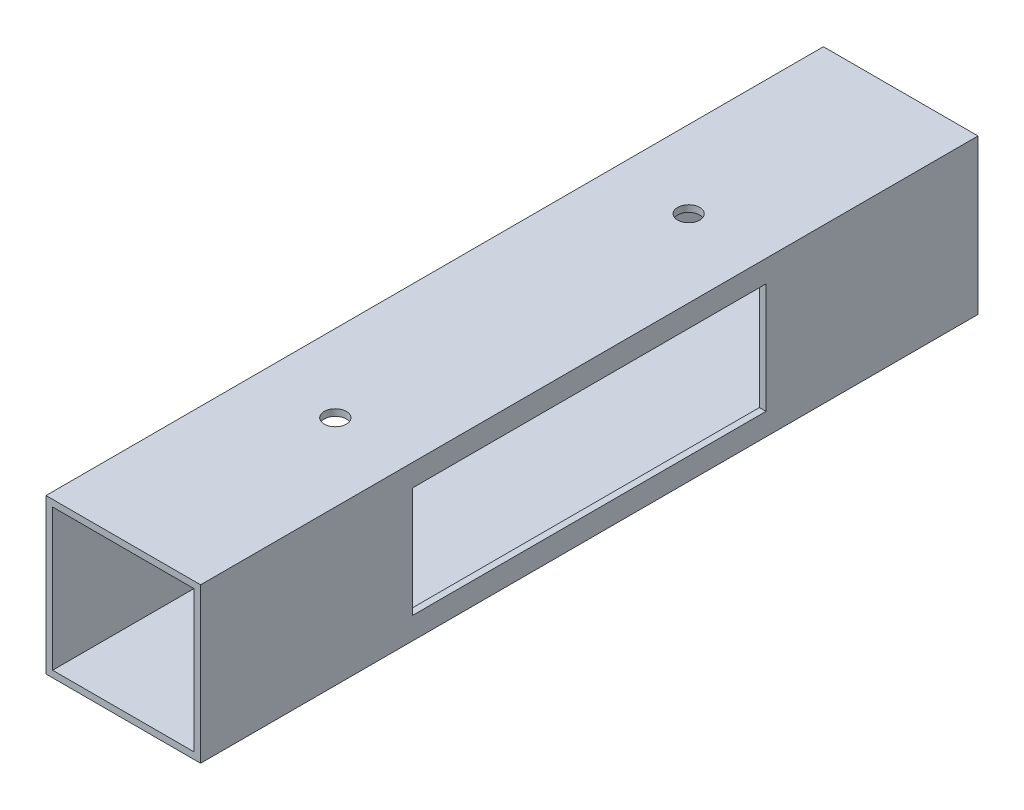
ISO-10303-21;
HEADER;
FILE_DESCRIPTION(('STEP AP214'),'2;1');
FILE_NAME('part.step','',(''),(''),'','','');
FILE_SCHEMA(('AUTOMOTIVE_DESIGN { 1 0 10303 214 1 1 1 1 }'));
ENDSEC;
DATA;
#1=APPLICATION_CONTEXT('core data for automotive mechanical design processes');
#2=APPLICATION_PROTOCOL_DEFINITION('international standard','automotive_design',2000,#1);
#3=PRODUCT_CONTEXT('',#1,'mechanical');
#4=PRODUCT('Part','Part','',(#3));
#5=PRODUCT_RELATED_PRODUCT_CATEGORY('part','',(#4));
#6=PRODUCT_DEFINITION_FORMATION('','',#4);
#7=PRODUCT_DEFINITION_CONTEXT('part definition',#1,'design');
#8=PRODUCT_DEFINITION('design','',#6,#7);
#9=PRODUCT_DEFINITION_SHAPE('','',#8);
#10=(LENGTH_UNIT() NAMED_UNIT(*) SI_UNIT(.MILLI.,.METRE.));
#11=(NAMED_UNIT(*) PLANE_ANGLE_UNIT() SI_UNIT($,.RADIAN.));
#12=(NAMED_UNIT(*) SI_UNIT($,.STERADIAN.) SOLID_ANGLE_UNIT());
#13=UNCERTAINTY_MEASURE_WITH_UNIT(LENGTH_MEASURE(1.E-05),#10,'distance_accuracy_value','');
#14=(GEOMETRIC_REPRESENTATION_CONTEXT(3) GLOBAL_UNCERTAINTY_ASSIGNED_CONTEXT((#13)) GLOBAL_UNIT_ASSIGNED_CONTEXT((#10,
#11,#12)) REPRESENTATION_CONTEXT('',''));
#15=CARTESIAN_POINT('',(0.,0.,0.));
#16=DIRECTION('',(0.,0.,1.));
#17=DIRECTION('',(1.,0.,0.));
#18=AXIS2_PLACEMENT_3D('',#15,#16,#17);
#19=CARTESIAN_POINT('',(0.,0.,88.));
#20=DIRECTION('',(0.,0.,-1.));
#21=DIRECTION('',(-1.,0.,0.));
#22=AXIS2_PLACEMENT_3D('',#19,#20,#21);
#23=PLANE('',#22);
#24=DIRECTION('',(0.,-1.,0.));
#25=VECTOR('',#24,1.);
#26=CARTESIAN_POINT('',(-17.5,-17.5,88.));
#27=LINE('',#26,#25);
#28=CARTESIAN_POINT('',(-17.5,17.5,88.));
#29=VERTEX_POINT('',#28);
#30=CARTESIAN_POINT('',(-17.5,-17.5,88.));
#31=VERTEX_POINT('',#30);
#32=EDGE_CURVE('E236',#29,#31,#27,.T.);
#33=ORIENTED_EDGE('',*,*,#32,.T.);
#34=DIRECTION('',(1.,0.,0.));
#35=VECTOR('',#34,1.);
#36=CARTESIAN_POINT('',(-17.5,-17.5,88.));
#37=LINE('',#36,#35);
#38=CARTESIAN_POINT('',(17.5,-17.5,88.));
#39=VERTEX_POINT('',#38);
#40=EDGE_CURVE('E239',#31,#39,#37,.T.);
#41=ORIENTED_EDGE('',*,*,#40,.T.);
#42=DIRECTION('',(0.,1.,0.));
#43=VECTOR('',#42,1.);
#44=CARTESIAN_POINT('',(17.5,-17.5,88.));
#45=LINE('',#44,#43);
#46=CARTESIAN_POINT('',(17.5,17.5,88.));
#47=VERTEX_POINT('',#46);
#48=EDGE_CURVE('E242',#39,#47,#45,.T.);
#49=ORIENTED_EDGE('',*,*,#48,.T.);
#50=DIRECTION('',(-1.,0.,0.));
#51=VECTOR('',#50,1.);
#52=CARTESIAN_POINT('',(-17.5,17.5,88.));
#53=LINE('',#52,#51);
#54=EDGE_CURVE('E244',#47,#29,#53,.T.);
#55=ORIENTED_EDGE('',*,*,#54,.T.);
#56=EDGE_LOOP('',(#33,#41,#49,#55));
#57=FACE_BOUND('',#56,.T.);
#58=DIRECTION('',(0.,-1.,0.));
#59=VECTOR('',#58,1.);
#60=CARTESIAN_POINT('',(-16.,-16.,88.));
#61=LINE('',#60,#59);
#62=CARTESIAN_POINT('',(-16.,16.,88.));
#63=VERTEX_POINT('',#62);
#64=CARTESIAN_POINT('',(-16.,-16.,88.));
#65=VERTEX_POINT('',#64);
#66=EDGE_CURVE('E205',#63,#65,#61,.T.);
#67=ORIENTED_EDGE('',*,*,#66,.F.);
#68=DIRECTION('',(-1.,0.,0.));
#69=VECTOR('',#68,1.);
#70=CARTESIAN_POINT('',(-16.,16.,88.));
#71=LINE('',#70,#69);
#72=CARTESIAN_POINT('',(16.,16.,88.));
#73=VERTEX_POINT('',#72);
#74=EDGE_CURVE('E213',#73,#63,#71,.T.);
#75=ORIENTED_EDGE('',*,*,#74,.F.);
#76=DIRECTION('',(0.,1.,0.));
#77=VECTOR('',#76,1.);
#78=CARTESIAN_POINT('',(16.,-16.,88.));
#79=LINE('',#78,#77);
#80=CARTESIAN_POINT('',(16.,-16.,88.));
#81=VERTEX_POINT('',#80);
#82=EDGE_CURVE('E210',#81,#73,#79,.T.);
#83=ORIENTED_EDGE('',*,*,#82,.F.);
#84=DIRECTION('',(1.,0.,0.));
#85=VECTOR('',#84,1.);
#86=CARTESIAN_POINT('',(-16.,-16.,88.));
#87=LINE('',#86,#85);
#88=EDGE_CURVE('E207',#65,#81,#87,.T.);
#89=ORIENTED_EDGE('',*,*,#88,.F.);
#90=EDGE_LOOP('',(#67,#75,#83,#89));
#91=FACE_BOUND('',#90,.T.);
#92=ADVANCED_FACE('F32',(#57,#91),#23,.F.);
#93=CARTESIAN_POINT('',(0.,0.,-88.));
#94=DIRECTION('',(0.,0.,-1.));
#95=DIRECTION('',(-1.,0.,0.));
#96=AXIS2_PLACEMENT_3D('',#93,#94,#95);
#97=PLANE('',#96);
#98=DIRECTION('',(0.,-1.,0.));
#99=VECTOR('',#98,1.);
#100=CARTESIAN_POINT('',(-17.5,-17.5,-88.));
#101=LINE('',#100,#99);
#102=CARTESIAN_POINT('',(-17.5,17.5,-88.));
#103=VERTEX_POINT('',#102);
#104=CARTESIAN_POINT('',(-17.5,-17.5,-88.));
#105=VERTEX_POINT('',#104);
#106=EDGE_CURVE('E235',#103,#105,#101,.T.);
#107=ORIENTED_EDGE('',*,*,#106,.F.);
#108=DIRECTION('',(-1.,0.,0.));
#109=VECTOR('',#108,1.);
#110=CARTESIAN_POINT('',(-17.5,17.5,-88.));
#111=LINE('',#110,#109);
#112=CARTESIAN_POINT('',(17.5,17.5,-88.));
#113=VERTEX_POINT('',#112);
#114=EDGE_CURVE('E240',#113,#103,#111,.T.);
#115=ORIENTED_EDGE('',*,*,#114,.F.);
#116=DIRECTION('',(0.,1.,0.));
#117=VECTOR('',#116,1.);
#118=CARTESIAN_POINT('',(17.5,-17.5,-88.));
#119=LINE('',#118,#117);
#120=CARTESIAN_POINT('',(17.5,-17.5,-88.));
#121=VERTEX_POINT('',#120);
#122=EDGE_CURVE('E251',#121,#113,#119,.T.);
#123=ORIENTED_EDGE('',*,*,#122,.F.);
#124=DIRECTION('',(1.,0.,0.));
#125=VECTOR('',#124,1.);
#126=CARTESIAN_POINT('',(-17.5,-17.5,-88.));
#127=LINE('',#126,#125);
#128=EDGE_CURVE('E249',#105,#121,#127,.T.);
#129=ORIENTED_EDGE('',*,*,#128,.F.);
#130=EDGE_LOOP('',(#107,#115,#123,#129));
#131=FACE_BOUND('',#130,.T.);
#132=DIRECTION('',(-1.,0.,0.));
#133=VECTOR('',#132,1.);
#134=CARTESIAN_POINT('',(-16.,16.,-88.));
#135=LINE('',#134,#133);
#136=CARTESIAN_POINT('',(16.,16.,-88.));
#137=VERTEX_POINT('',#136);
#138=CARTESIAN_POINT('',(-16.,16.,-88.));
#139=VERTEX_POINT('',#138);
#140=EDGE_CURVE('E208',#137,#139,#135,.T.);
#141=ORIENTED_EDGE('',*,*,#140,.T.);
#142=DIRECTION('',(0.,-1.,0.));
#143=VECTOR('',#142,1.);
#144=CARTESIAN_POINT('',(-16.,-16.,-88.));
#145=LINE('',#144,#143);
#146=CARTESIAN_POINT('',(-16.,-16.,-88.));
#147=VERTEX_POINT('',#146);
#148=EDGE_CURVE('E204',#139,#147,#145,.T.);
#149=ORIENTED_EDGE('',*,*,#148,.T.);
#150=DIRECTION('',(1.,0.,0.));
#151=VECTOR('',#150,1.);
#152=CARTESIAN_POINT('',(-16.,-16.,-88.));
#153=LINE('',#152,#151);
#154=CARTESIAN_POINT('',(16.,-16.,-88.));
#155=VERTEX_POINT('',#154);
#156=EDGE_CURVE('E218',#147,#155,#153,.T.);
#157=ORIENTED_EDGE('',*,*,#156,.T.);
#158=DIRECTION('',(0.,1.,0.));
#159=VECTOR('',#158,1.);
#160=CARTESIAN_POINT('',(16.,-16.,-88.));
#161=LINE('',#160,#159);
#162=EDGE_CURVE('E221',#155,#137,#161,.T.);
#163=ORIENTED_EDGE('',*,*,#162,.T.);
#164=EDGE_LOOP('',(#141,#149,#157,#163));
#165=FACE_BOUND('',#164,.T.);
#166=ADVANCED_FACE('F301',(#131,#165),#97,.T.);
#167=CARTESIAN_POINT('',(-17.5,-17.5,88.));
#168=DIRECTION('',(1.,0.,0.));
#169=DIRECTION('',(0.,0.,-1.));
#170=AXIS2_PLACEMENT_3D('',#167,#168,#169);
#171=PLANE('',#170);
#172=DIRECTION('',(0.,0.,1.));
#173=VECTOR('',#172,1.);
#174=CARTESIAN_POINT('',(-17.5,12.5,40.));
#175=LINE('',#174,#173);
#176=CARTESIAN_POINT('',(-17.5,12.5,-40.));
#177=VERTEX_POINT('',#176);
#178=CARTESIAN_POINT('',(-17.5,12.5,40.));
#179=VERTEX_POINT('',#178);
#180=EDGE_CURVE('E170',#177,#179,#175,.T.);
#181=ORIENTED_EDGE('',*,*,#180,.T.);
#182=DIRECTION('',(0.,-1.,0.));
#183=VECTOR('',#182,1.);
#184=CARTESIAN_POINT('',(-17.5,12.5,40.));
#185=LINE('',#184,#183);
#186=CARTESIAN_POINT('',(-17.5,-12.5,40.));
#187=VERTEX_POINT('',#186);
#188=EDGE_CURVE('E153',#179,#187,#185,.T.);
#189=ORIENTED_EDGE('',*,*,#188,.T.);
#190=DIRECTION('',(0.,0.,-1.));
#191=VECTOR('',#190,1.);
#192=CARTESIAN_POINT('',(-17.5,-12.5,40.));
#193=LINE('',#192,#191);
#194=CARTESIAN_POINT('',(-17.5,-12.5,-40.));
#195=VERTEX_POINT('',#194);
#196=EDGE_CURVE('E163',#187,#195,#193,.T.);
#197=ORIENTED_EDGE('',*,*,#196,.T.);
#198=DIRECTION('',(0.,1.,0.));
#199=VECTOR('',#198,1.);
#200=CARTESIAN_POINT('',(-17.5,12.5,-40.));
#201=LINE('',#200,#199);
#202=EDGE_CURVE('E49',#195,#177,#201,.T.);
#203=ORIENTED_EDGE('',*,*,#202,.T.);
#204=EDGE_LOOP('',(#181,#189,#197,#203));
#205=FACE_BOUND('',#204,.T.);
#206=ORIENTED_EDGE('',*,*,#106,.T.);
#207=DIRECTION('',(0.,0.,-1.));
#208=VECTOR('',#207,1.);
#209=CARTESIAN_POINT('',(-17.5,-17.5,88.));
#210=LINE('',#209,#208);
#211=EDGE_CURVE('E262',#31,#105,#210,.T.);
#212=ORIENTED_EDGE('',*,*,#211,.F.);
#213=ORIENTED_EDGE('',*,*,#32,.F.);
#214=DIRECTION('',(0.,0.,-1.));
#215=VECTOR('',#214,1.);
#216=CARTESIAN_POINT('',(-17.5,17.5,88.));
#217=LINE('',#216,#215);
#218=EDGE_CURVE('E246',#29,#103,#217,.T.);
#219=ORIENTED_EDGE('',*,*,#218,.T.);
#220=EDGE_LOOP('',(#206,#212,#213,#219));
#221=FACE_BOUND('',#220,.T.);
#222=ADVANCED_FACE('F34',(#205,#221),#171,.F.);
#223=CARTESIAN_POINT('',(-17.5,-17.5,88.));
#224=DIRECTION('',(0.,1.,0.));
#225=DIRECTION('',(0.,0.,1.));
#226=AXIS2_PLACEMENT_3D('',#223,#224,#225);
#227=PLANE('',#226);
#228=ORIENTED_EDGE('',*,*,#128,.T.);
#229=DIRECTION('',(0.,0.,-1.));
#230=VECTOR('',#229,1.);
#231=CARTESIAN_POINT('',(17.5,-17.5,88.));
#232=LINE('',#231,#230);
#233=EDGE_CURVE('E259',#39,#121,#232,.T.);
#234=ORIENTED_EDGE('',*,*,#233,.F.);
#235=ORIENTED_EDGE('',*,*,#40,.F.);
#236=ORIENTED_EDGE('',*,*,#211,.T.);
#237=EDGE_LOOP('',(#228,#234,#235,#236));
#238=FACE_BOUND('',#237,.T.);
#239=ADVANCED_FACE('F305',(#238),#227,.F.);
#240=CARTESIAN_POINT('',(17.5,-17.5,88.));
#241=DIRECTION('',(-1.,0.,0.));
#242=DIRECTION('',(0.,-1.,0.));
#243=AXIS2_PLACEMENT_3D('',#240,#241,#242);
#244=PLANE('',#243);
#245=DIRECTION('',(0.,0.,-1.));
#246=VECTOR('',#245,1.);
#247=CARTESIAN_POINT('',(17.5,-12.5,40.));
#248=LINE('',#247,#246);
#249=CARTESIAN_POINT('',(17.5,-12.5,40.));
#250=VERTEX_POINT('',#249);
#251=CARTESIAN_POINT('',(17.5,-12.5,-40.));
#252=VERTEX_POINT('',#251);
#253=EDGE_CURVE('E183',#250,#252,#248,.T.);
#254=ORIENTED_EDGE('',*,*,#253,.F.);
#255=DIRECTION('',(0.,-1.,0.));
#256=VECTOR('',#255,1.);
#257=CARTESIAN_POINT('',(17.5,12.5,40.));
#258=LINE('',#257,#256);
#259=CARTESIAN_POINT('',(17.5,12.5,40.));
#260=VERTEX_POINT('',#259);
#261=EDGE_CURVE('E57',#260,#250,#258,.T.);
#262=ORIENTED_EDGE('',*,*,#261,.F.);
#263=DIRECTION('',(0.,0.,1.));
#264=VECTOR('',#263,1.);
#265=CARTESIAN_POINT('',(17.5,12.5,40.));
#266=LINE('',#265,#264);
#267=CARTESIAN_POINT('',(17.5,12.5,-40.));
#268=VERTEX_POINT('',#267);
#269=EDGE_CURVE('E171',#268,#260,#266,.T.);
#270=ORIENTED_EDGE('',*,*,#269,.F.);
#271=DIRECTION('',(0.,1.,0.));
#272=VECTOR('',#271,1.);
#273=CARTESIAN_POINT('',(17.5,12.5,-40.));
#274=LINE('',#273,#272);
#275=EDGE_CURVE('E174',#252,#268,#274,.T.);
#276=ORIENTED_EDGE('',*,*,#275,.F.);
#277=EDGE_LOOP('',(#254,#262,#270,#276));
#278=FACE_BOUND('',#277,.T.);
#279=ORIENTED_EDGE('',*,*,#122,.T.);
#280=DIRECTION('',(0.,0.,-1.));
#281=VECTOR('',#280,1.);
#282=CARTESIAN_POINT('',(17.5,17.5,88.));
#283=LINE('',#282,#281);
#284=EDGE_CURVE('E256',#47,#113,#283,.T.);
#285=ORIENTED_EDGE('',*,*,#284,.F.);
#286=ORIENTED_EDGE('',*,*,#48,.F.);
#287=ORIENTED_EDGE('',*,*,#233,.T.);
#288=EDGE_LOOP('',(#279,#285,#286,#287));
#289=FACE_BOUND('',#288,.T.);
#290=ADVANCED_FACE('F289',(#278,#289),#244,.F.);
#291=CARTESIAN_POINT('',(-17.5,17.5,88.));
#292=DIRECTION('',(0.,-1.,0.));
#293=DIRECTION('',(0.,0.,-1.));
#294=AXIS2_PLACEMENT_3D('',#291,#292,#293);
#295=PLANE('',#294);
#296=CARTESIAN_POINT('',(0.,17.5,40.));
#297=DIRECTION('',(0.,1.,0.));
#298=DIRECTION('',(0.,0.,1.));
#299=AXIS2_PLACEMENT_3D('',#296,#297,#298);
#300=CIRCLE('',#299,2.5);
#301=CARTESIAN_POINT('',(0.,17.5,42.5));
#302=VERTEX_POINT('',#301);
#303=EDGE_CURVE('E277',#302,#302,#300,.T.);
#304=ORIENTED_EDGE('',*,*,#303,.F.);
#305=EDGE_LOOP('',(#304));
#306=FACE_BOUND('',#305,.T.);
#307=CARTESIAN_POINT('',(0.,17.5,-40.));
#308=DIRECTION('',(0.,1.,0.));
#309=DIRECTION('',(0.,0.,1.));
#310=AXIS2_PLACEMENT_3D('',#307,#308,#309);
#311=CIRCLE('',#310,2.5);
#312=CARTESIAN_POINT('',(0.,17.5,-37.5));
#313=VERTEX_POINT('',#312);
#314=EDGE_CURVE('E177',#313,#313,#311,.T.);
#315=ORIENTED_EDGE('',*,*,#314,.F.);
#316=EDGE_LOOP('',(#315));
#317=FACE_BOUND('',#316,.T.);
#318=ORIENTED_EDGE('',*,*,#114,.T.);
#319=ORIENTED_EDGE('',*,*,#218,.F.);
#320=ORIENTED_EDGE('',*,*,#54,.F.);
#321=ORIENTED_EDGE('',*,*,#284,.T.);
#322=EDGE_LOOP('',(#318,#319,#320,#321));
#323=FACE_BOUND('',#322,.T.);
#324=ADVANCED_FACE('F285',(#306,#317,#323),#295,.F.);
#325=CARTESIAN_POINT('',(-16.,-16.,88.));
#326=DIRECTION('',(1.,0.,0.));
#327=DIRECTION('',(0.,0.,-1.));
#328=AXIS2_PLACEMENT_3D('',#325,#326,#327);
#329=PLANE('',#328);
#330=DIRECTION('',(0.,-1.,0.));
#331=VECTOR('',#330,1.);
#332=CARTESIAN_POINT('',(-16.,-16.,40.));
#333=LINE('',#332,#331);
#334=CARTESIAN_POINT('',(-16.,12.5,40.));
#335=VERTEX_POINT('',#334);
#336=CARTESIAN_POINT('',(-16.,-12.5,40.));
#337=VERTEX_POINT('',#336);
#338=EDGE_CURVE('E156',#335,#337,#333,.T.);
#339=ORIENTED_EDGE('',*,*,#338,.F.);
#340=DIRECTION('',(0.,0.,1.));
#341=VECTOR('',#340,1.);
#342=CARTESIAN_POINT('',(-16.,12.5,88.));
#343=LINE('',#342,#341);
#344=CARTESIAN_POINT('',(-16.,12.5,-40.));
#345=VERTEX_POINT('',#344);
#346=EDGE_CURVE('E201',#345,#335,#343,.T.);
#347=ORIENTED_EDGE('',*,*,#346,.F.);
#348=DIRECTION('',(0.,1.,0.));
#349=VECTOR('',#348,1.);
#350=CARTESIAN_POINT('',(-16.,-16.,-40.));
#351=LINE('',#350,#349);
#352=CARTESIAN_POINT('',(-16.,-12.5,-40.));
#353=VERTEX_POINT('',#352);
#354=EDGE_CURVE('E199',#353,#345,#351,.T.);
#355=ORIENTED_EDGE('',*,*,#354,.F.);
#356=DIRECTION('',(0.,0.,-1.));
#357=VECTOR('',#356,1.);
#358=CARTESIAN_POINT('',(-16.,-12.5,88.));
#359=LINE('',#358,#357);
#360=EDGE_CURVE('E191',#337,#353,#359,.T.);
#361=ORIENTED_EDGE('',*,*,#360,.F.);
#362=EDGE_LOOP('',(#339,#347,#355,#361));
#363=FACE_BOUND('',#362,.T.);
#364=ORIENTED_EDGE('',*,*,#148,.F.);
#365=DIRECTION('',(0.,0.,-1.));
#366=VECTOR('',#365,1.);
#367=CARTESIAN_POINT('',(-16.,16.,88.));
#368=LINE('',#367,#366);
#369=EDGE_CURVE('E215',#63,#139,#368,.T.);
#370=ORIENTED_EDGE('',*,*,#369,.F.);
#371=ORIENTED_EDGE('',*,*,#66,.T.);
#372=DIRECTION('',(0.,0.,-1.));
#373=VECTOR('',#372,1.);
#374=CARTESIAN_POINT('',(-16.,-16.,88.));
#375=LINE('',#374,#373);
#376=EDGE_CURVE('E232',#65,#147,#375,.T.);
#377=ORIENTED_EDGE('',*,*,#376,.T.);
#378=EDGE_LOOP('',(#364,#370,#371,#377));
#379=FACE_BOUND('',#378,.T.);
#380=ADVANCED_FACE('F288',(#363,#379),#329,.T.);
#381=CARTESIAN_POINT('',(-16.,-16.,88.));
#382=DIRECTION('',(0.,1.,0.));
#383=DIRECTION('',(0.,0.,1.));
#384=AXIS2_PLACEMENT_3D('',#381,#382,#383);
#385=PLANE('',#384);
#386=ORIENTED_EDGE('',*,*,#156,.F.);
#387=ORIENTED_EDGE('',*,*,#376,.F.);
#388=ORIENTED_EDGE('',*,*,#88,.T.);
#389=DIRECTION('',(0.,0.,-1.));
#390=VECTOR('',#389,1.);
#391=CARTESIAN_POINT('',(16.,-16.,88.));
#392=LINE('',#391,#390);
#393=EDGE_CURVE('E230',#81,#155,#392,.T.);
#394=ORIENTED_EDGE('',*,*,#393,.T.);
#395=EDGE_LOOP('',(#386,#387,#388,#394));
#396=FACE_BOUND('',#395,.T.);
#397=ADVANCED_FACE('F326',(#396),#385,.T.);
#398=CARTESIAN_POINT('',(16.,-16.,88.));
#399=DIRECTION('',(-1.,0.,0.));
#400=DIRECTION('',(0.,0.,1.));
#401=AXIS2_PLACEMENT_3D('',#398,#399,#400);
#402=PLANE('',#401);
#403=DIRECTION('',(0.,1.,0.));
#404=VECTOR('',#403,1.);
#405=CARTESIAN_POINT('',(16.,-16.,40.));
#406=LINE('',#405,#404);
#407=CARTESIAN_POINT('',(16.,-12.5,40.));
#408=VERTEX_POINT('',#407);
#409=CARTESIAN_POINT('',(16.,12.5,40.));
#410=VERTEX_POINT('',#409);
#411=EDGE_CURVE('E11',#408,#410,#406,.T.);
#412=ORIENTED_EDGE('',*,*,#411,.F.);
#413=DIRECTION('',(0.,0.,1.));
#414=VECTOR('',#413,1.);
#415=CARTESIAN_POINT('',(16.,-12.5,88.));
#416=LINE('',#415,#414);
#417=CARTESIAN_POINT('',(16.,-12.5,-40.));
#418=VERTEX_POINT('',#417);
#419=EDGE_CURVE('E265',#418,#408,#416,.T.);
#420=ORIENTED_EDGE('',*,*,#419,.F.);
#421=DIRECTION('',(0.,-1.,0.));
#422=VECTOR('',#421,1.);
#423=CARTESIAN_POINT('',(16.,-16.,-40.));
#424=LINE('',#423,#422);
#425=CARTESIAN_POINT('',(16.,12.5,-40.));
#426=VERTEX_POINT('',#425);
#427=EDGE_CURVE('E267',#426,#418,#424,.T.);
#428=ORIENTED_EDGE('',*,*,#427,.F.);
#429=DIRECTION('',(0.,0.,-1.));
#430=VECTOR('',#429,1.);
#431=CARTESIAN_POINT('',(16.,12.5,88.));
#432=LINE('',#431,#430);
#433=EDGE_CURVE('E41',#410,#426,#432,.T.);
#434=ORIENTED_EDGE('',*,*,#433,.F.);
#435=EDGE_LOOP('',(#412,#420,#428,#434));
#436=FACE_BOUND('',#435,.T.);
#437=ORIENTED_EDGE('',*,*,#162,.F.);
#438=ORIENTED_EDGE('',*,*,#393,.F.);
#439=ORIENTED_EDGE('',*,*,#82,.T.);
#440=DIRECTION('',(0.,0.,-1.));
#441=VECTOR('',#440,1.);
#442=CARTESIAN_POINT('',(16.,16.,88.));
#443=LINE('',#442,#441);
#444=EDGE_CURVE('E228',#73,#137,#443,.T.);
#445=ORIENTED_EDGE('',*,*,#444,.T.);
#446=EDGE_LOOP('',(#437,#438,#439,#445));
#447=FACE_BOUND('',#446,.T.);
#448=ADVANCED_FACE('F330',(#436,#447),#402,.T.);
#449=CARTESIAN_POINT('',(-16.,16.,88.));
#450=DIRECTION('',(0.,-1.,0.));
#451=DIRECTION('',(0.,0.,-1.));
#452=AXIS2_PLACEMENT_3D('',#449,#450,#451);
#453=PLANE('',#452);
#454=CARTESIAN_POINT('',(0.,16.,40.));
#455=DIRECTION('',(0.,-1.,0.));
#456=DIRECTION('',(0.,0.,-1.));
#457=AXIS2_PLACEMENT_3D('',#454,#455,#456);
#458=CIRCLE('',#457,2.5);
#459=CARTESIAN_POINT('',(0.,16.,37.5));
#460=VERTEX_POINT('',#459);
#461=EDGE_CURVE('E36',#460,#460,#458,.T.);
#462=ORIENTED_EDGE('',*,*,#461,.F.);
#463=EDGE_LOOP('',(#462));
#464=FACE_BOUND('',#463,.T.);
#465=CARTESIAN_POINT('',(0.,16.,-40.));
#466=DIRECTION('',(0.,-1.,0.));
#467=DIRECTION('',(0.,0.,-1.));
#468=AXIS2_PLACEMENT_3D('',#465,#466,#467);
#469=CIRCLE('',#468,2.5);
#470=CARTESIAN_POINT('',(0.,16.,-42.5));
#471=VERTEX_POINT('',#470);
#472=EDGE_CURVE('E184',#471,#471,#469,.T.);
#473=ORIENTED_EDGE('',*,*,#472,.F.);
#474=EDGE_LOOP('',(#473));
#475=FACE_BOUND('',#474,.T.);
#476=ORIENTED_EDGE('',*,*,#140,.F.);
#477=ORIENTED_EDGE('',*,*,#444,.F.);
#478=ORIENTED_EDGE('',*,*,#74,.T.);
#479=ORIENTED_EDGE('',*,*,#369,.T.);
#480=EDGE_LOOP('',(#476,#477,#478,#479));
#481=FACE_BOUND('',#480,.T.);
#482=ADVANCED_FACE('F334',(#464,#475,#481),#453,.T.);
#483=CARTESIAN_POINT('',(-17.5,-12.5,40.));
#484=DIRECTION('',(0.,-1.,0.));
#485=DIRECTION('',(1.,0.,0.));
#486=AXIS2_PLACEMENT_3D('',#483,#484,#485);
#487=PLANE('',#486);
#488=ORIENTED_EDGE('',*,*,#419,.T.);
#489=DIRECTION('',(1.,0.,0.));
#490=VECTOR('',#489,1.);
#491=CARTESIAN_POINT('',(-17.5,-12.5,40.));
#492=LINE('',#491,#490);
#493=EDGE_CURVE('E160',#408,#250,#492,.T.);
#494=ORIENTED_EDGE('',*,*,#493,.T.);
#495=ORIENTED_EDGE('',*,*,#253,.T.);
#496=DIRECTION('',(1.,0.,0.));
#497=VECTOR('',#496,1.);
#498=CARTESIAN_POINT('',(-17.5,-12.5,-40.));
#499=LINE('',#498,#497);
#500=EDGE_CURVE('E159',#418,#252,#499,.T.);
#501=ORIENTED_EDGE('',*,*,#500,.F.);
#502=EDGE_LOOP('',(#488,#494,#495,#501));
#503=FACE_BOUND('',#502,.T.);
#504=ADVANCED_FACE('F338',(#503),#487,.F.);
#505=CARTESIAN_POINT('',(-17.5,12.5,-40.));
#506=DIRECTION('',(0.,0.,-1.));
#507=DIRECTION('',(0.,1.,0.));
#508=AXIS2_PLACEMENT_3D('',#505,#506,#507);
#509=PLANE('',#508);
#510=ORIENTED_EDGE('',*,*,#427,.T.);
#511=ORIENTED_EDGE('',*,*,#500,.T.);
#512=ORIENTED_EDGE('',*,*,#275,.T.);
#513=DIRECTION('',(1.,0.,0.));
#514=VECTOR('',#513,1.);
#515=CARTESIAN_POINT('',(-17.5,12.5,-40.));
#516=LINE('',#515,#514);
#517=EDGE_CURVE('E196',#426,#268,#516,.T.);
#518=ORIENTED_EDGE('',*,*,#517,.F.);
#519=EDGE_LOOP('',(#510,#511,#512,#518));
#520=FACE_BOUND('',#519,.T.);
#521=ADVANCED_FACE('F346',(#520),#509,.F.);
#522=CARTESIAN_POINT('',(-17.5,12.5,40.));
#523=DIRECTION('',(0.,1.,0.));
#524=DIRECTION('',(-1.,0.,0.));
#525=AXIS2_PLACEMENT_3D('',#522,#523,#524);
#526=PLANE('',#525);
#527=ORIENTED_EDGE('',*,*,#433,.T.);
#528=ORIENTED_EDGE('',*,*,#517,.T.);
#529=ORIENTED_EDGE('',*,*,#269,.T.);
#530=DIRECTION('',(1.,0.,0.));
#531=VECTOR('',#530,1.);
#532=CARTESIAN_POINT('',(-17.5,12.5,40.));
#533=LINE('',#532,#531);
#534=EDGE_CURVE('E192',#410,#260,#533,.T.);
#535=ORIENTED_EDGE('',*,*,#534,.F.);
#536=EDGE_LOOP('',(#527,#528,#529,#535));
#537=FACE_BOUND('',#536,.T.);
#538=ADVANCED_FACE('F343',(#537),#526,.F.);
#539=CARTESIAN_POINT('',(-17.5,12.5,40.));
#540=DIRECTION('',(0.,0.,1.));
#541=DIRECTION('',(1.,0.,0.));
#542=AXIS2_PLACEMENT_3D('',#539,#540,#541);
#543=PLANE('',#542);
#544=ORIENTED_EDGE('',*,*,#411,.T.);
#545=ORIENTED_EDGE('',*,*,#534,.T.);
#546=ORIENTED_EDGE('',*,*,#261,.T.);
#547=ORIENTED_EDGE('',*,*,#493,.F.);
#548=EDGE_LOOP('',(#544,#545,#546,#547));
#549=FACE_BOUND('',#548,.T.);
#550=ADVANCED_FACE('F340',(#549),#543,.F.);
#551=ORIENTED_EDGE('',*,*,#338,.T.);
#552=EDGE_CURVE('E148',#187,#337,#492,.T.);
#553=ORIENTED_EDGE('',*,*,#552,.F.);
#554=ORIENTED_EDGE('',*,*,#188,.F.);
#555=EDGE_CURVE('E189',#179,#335,#533,.T.);
#556=ORIENTED_EDGE('',*,*,#555,.T.);
#557=EDGE_LOOP('',(#551,#553,#554,#556));
#558=FACE_BOUND('',#557,.T.);
#559=ADVANCED_FACE('F150',(#558),#543,.F.);
#560=ORIENTED_EDGE('',*,*,#346,.T.);
#561=ORIENTED_EDGE('',*,*,#555,.F.);
#562=ORIENTED_EDGE('',*,*,#180,.F.);
#563=EDGE_CURVE('E193',#177,#345,#516,.T.);
#564=ORIENTED_EDGE('',*,*,#563,.T.);
#565=EDGE_LOOP('',(#560,#561,#562,#564));
#566=FACE_BOUND('',#565,.T.);
#567=ADVANCED_FACE('F355',(#566),#526,.F.);
#568=ORIENTED_EDGE('',*,*,#354,.T.);
#569=ORIENTED_EDGE('',*,*,#563,.F.);
#570=ORIENTED_EDGE('',*,*,#202,.F.);
#571=EDGE_CURVE('E165',#195,#353,#499,.T.);
#572=ORIENTED_EDGE('',*,*,#571,.T.);
#573=EDGE_LOOP('',(#568,#569,#570,#572));
#574=FACE_BOUND('',#573,.T.);
#575=ADVANCED_FACE('F351',(#574),#509,.F.);
#576=ORIENTED_EDGE('',*,*,#360,.T.);
#577=ORIENTED_EDGE('',*,*,#571,.F.);
#578=ORIENTED_EDGE('',*,*,#196,.F.);
#579=ORIENTED_EDGE('',*,*,#552,.T.);
#580=EDGE_LOOP('',(#576,#577,#578,#579));
#581=FACE_BOUND('',#580,.T.);
#582=ADVANCED_FACE('F164',(#581),#487,.F.);
#583=CARTESIAN_POINT('',(0.,12.5,-40.));
#584=DIRECTION('',(0.,1.,0.));
#585=DIRECTION('',(0.,0.,1.));
#586=AXIS2_PLACEMENT_3D('',#583,#584,#585);
#587=CYLINDRICAL_SURFACE('',#586,2.5);
#588=ORIENTED_EDGE('',*,*,#472,.T.);
#589=EDGE_LOOP('',(#588));
#590=FACE_BOUND('',#589,.T.);
#591=ORIENTED_EDGE('',*,*,#314,.T.);
#592=EDGE_LOOP('',(#591));
#593=FACE_BOUND('',#592,.T.);
#594=ADVANCED_FACE('F356',(#590,#593),#587,.F.);
#595=CARTESIAN_POINT('',(0.,12.5,40.));
#596=DIRECTION('',(0.,1.,0.));
#597=DIRECTION('',(0.,0.,1.));
#598=AXIS2_PLACEMENT_3D('',#595,#596,#597);
#599=CYLINDRICAL_SURFACE('',#598,2.5);
#600=ORIENTED_EDGE('',*,*,#461,.T.);
#601=EDGE_LOOP('',(#600));
#602=FACE_BOUND('',#601,.T.);
#603=ORIENTED_EDGE('',*,*,#303,.T.);
#604=EDGE_LOOP('',(#603));
#605=FACE_BOUND('',#604,.T.);
#606=ADVANCED_FACE('F283',(#602,#605),#599,.F.);
#607=CLOSED_SHELL('',(#92,#166,#222,#239,#290,#324,#380,#397,#448,#482,#504,#521,#538,#550,#559,
#567,#575,#582,#594,#606));
#608=MANIFOLD_SOLID_BREP('B2',#607);
#609=ADVANCED_BREP_SHAPE_REPRESENTATION('',(#18,#608),#14);
#610=SHAPE_DEFINITION_REPRESENTATION(#9,#609);
ENDSEC;
END-ISO-10303-21;
